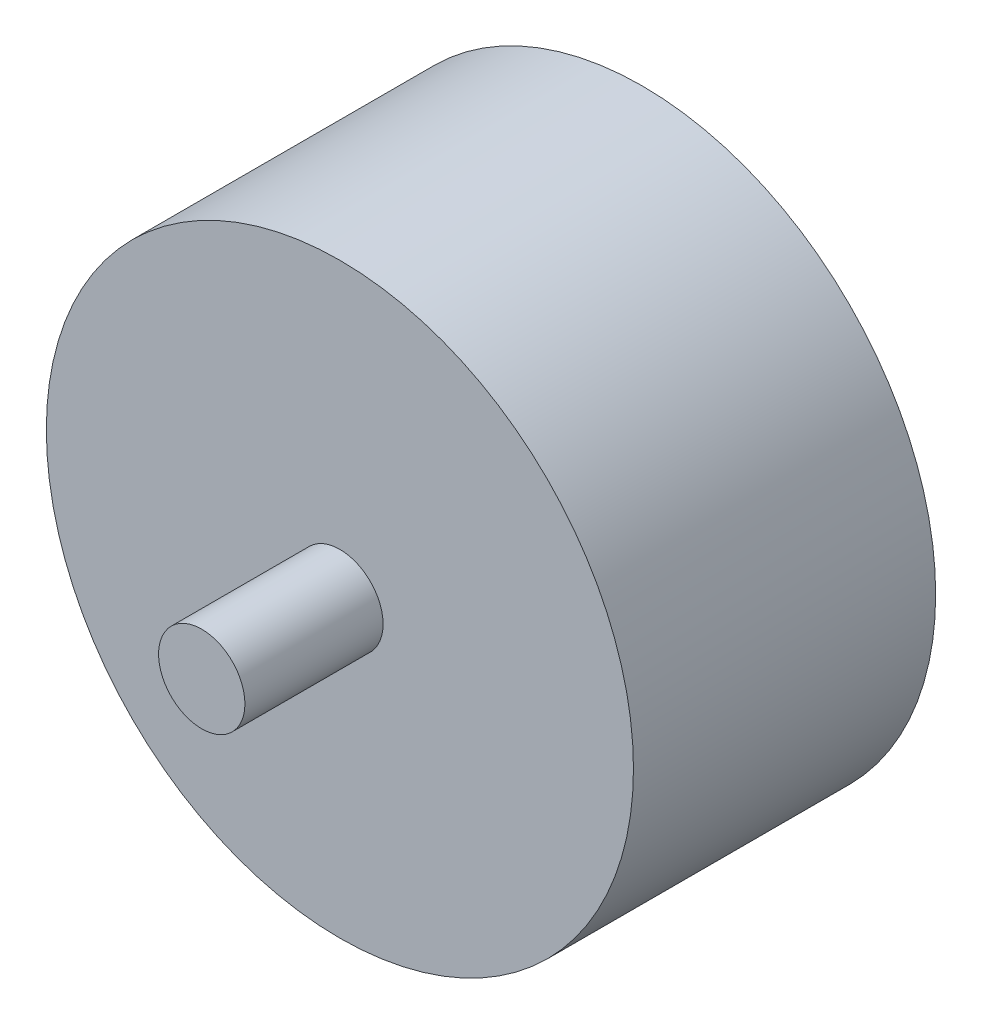
ISO-10303-21;
HEADER;
FILE_DESCRIPTION(('STEP AP214'),'2;1');
FILE_NAME('part.step','',(''),(''),'','','');
FILE_SCHEMA(('AUTOMOTIVE_DESIGN { 1 0 10303 214 1 1 1 1 }'));
ENDSEC;
DATA;
#1=APPLICATION_CONTEXT('core data for automotive mechanical design processes');
#2=APPLICATION_PROTOCOL_DEFINITION('international standard','automotive_design',2000,#1);
#3=PRODUCT_CONTEXT('',#1,'mechanical');
#4=PRODUCT('Part','Part','',(#3));
#5=PRODUCT_RELATED_PRODUCT_CATEGORY('part','',(#4));
#6=PRODUCT_DEFINITION_FORMATION('','',#4);
#7=PRODUCT_DEFINITION_CONTEXT('part definition',#1,'design');
#8=PRODUCT_DEFINITION('design','',#6,#7);
#9=PRODUCT_DEFINITION_SHAPE('','',#8);
#10=(LENGTH_UNIT() NAMED_UNIT(*) SI_UNIT(.MILLI.,.METRE.));
#11=(NAMED_UNIT(*) PLANE_ANGLE_UNIT() SI_UNIT($,.RADIAN.));
#12=(NAMED_UNIT(*) SI_UNIT($,.STERADIAN.) SOLID_ANGLE_UNIT());
#13=UNCERTAINTY_MEASURE_WITH_UNIT(LENGTH_MEASURE(1.E-05),#10,'distance_accuracy_value','');
#14=(GEOMETRIC_REPRESENTATION_CONTEXT(3) GLOBAL_UNCERTAINTY_ASSIGNED_CONTEXT((#13)) GLOBAL_UNIT_ASSIGNED_CONTEXT((#10,
#11,#12)) REPRESENTATION_CONTEXT('',''));
#15=CARTESIAN_POINT('',(0.,0.,0.));
#16=DIRECTION('',(0.,0.,1.));
#17=DIRECTION('',(1.,0.,0.));
#18=AXIS2_PLACEMENT_3D('',#15,#16,#17);
#19=CARTESIAN_POINT('',(0.,0.,25.5));
#20=DIRECTION('',(0.,0.,-1.));
#21=DIRECTION('',(-1.,0.,0.));
#22=AXIS2_PLACEMENT_3D('',#19,#20,#21);
#23=CYLINDRICAL_SURFACE('',#22,17.);
#24=CARTESIAN_POINT('',(0.,0.,0.));
#25=DIRECTION('',(0.,0.,1.));
#26=DIRECTION('',(1.,0.,0.));
#27=AXIS2_PLACEMENT_3D('',#24,#25,#26);
#28=CIRCLE('',#27,17.);
#29=CARTESIAN_POINT('',(17.,0.,0.));
#30=VERTEX_POINT('',#29);
#31=EDGE_CURVE('E11',#30,#30,#28,.T.);
#32=ORIENTED_EDGE('',*,*,#31,.T.);
#33=EDGE_LOOP('',(#32));
#34=FACE_BOUND('',#33,.T.);
#35=CARTESIAN_POINT('',(0.,0.,17.5));
#36=DIRECTION('',(0.,0.,1.));
#37=DIRECTION('',(1.,0.,0.));
#38=AXIS2_PLACEMENT_3D('',#35,#36,#37);
#39=CIRCLE('',#38,17.);
#40=CARTESIAN_POINT('',(17.,0.,17.5));
#41=VERTEX_POINT('',#40);
#42=EDGE_CURVE('E44',#41,#41,#39,.T.);
#43=ORIENTED_EDGE('',*,*,#42,.F.);
#44=EDGE_LOOP('',(#43));
#45=FACE_BOUND('',#44,.T.);
#46=ADVANCED_FACE('F38',(#34,#45),#23,.T.);
#47=CARTESIAN_POINT('',(0.,0.,0.));
#48=DIRECTION('',(0.,0.,1.));
#49=DIRECTION('',(1.,0.,0.));
#50=AXIS2_PLACEMENT_3D('',#47,#48,#49);
#51=PLANE('',#50);
#52=ORIENTED_EDGE('',*,*,#31,.F.);
#53=EDGE_LOOP('',(#52));
#54=FACE_BOUND('',#53,.T.);
#55=ADVANCED_FACE('F70',(#54),#51,.F.);
#56=CARTESIAN_POINT('',(0.,0.,17.5));
#57=DIRECTION('',(0.,0.,1.));
#58=DIRECTION('',(1.,0.,0.));
#59=AXIS2_PLACEMENT_3D('',#56,#57,#58);
#60=PLANE('',#59);
#61=CARTESIAN_POINT('',(0.,0.,17.5));
#62=DIRECTION('',(0.,0.,1.));
#63=DIRECTION('',(1.,0.,0.));
#64=AXIS2_PLACEMENT_3D('',#61,#62,#63);
#65=CIRCLE('',#64,2.5);
#66=CARTESIAN_POINT('',(2.5,0.,17.5));
#67=VERTEX_POINT('',#66);
#68=EDGE_CURVE('E48',#67,#67,#65,.T.);
#69=ORIENTED_EDGE('',*,*,#68,.F.);
#70=EDGE_LOOP('',(#69));
#71=FACE_BOUND('',#70,.T.);
#72=ORIENTED_EDGE('',*,*,#42,.T.);
#73=EDGE_LOOP('',(#72));
#74=FACE_BOUND('',#73,.T.);
#75=ADVANCED_FACE('F62',(#71,#74),#60,.T.);
#76=CARTESIAN_POINT('',(0.,0.,17.5));
#77=DIRECTION('',(0.,0.,1.));
#78=DIRECTION('',(1.,0.,0.));
#79=AXIS2_PLACEMENT_3D('',#76,#77,#78);
#80=CYLINDRICAL_SURFACE('',#79,2.5);
#81=ORIENTED_EDGE('',*,*,#68,.T.);
#82=EDGE_LOOP('',(#81));
#83=FACE_BOUND('',#82,.T.);
#84=CARTESIAN_POINT('',(0.,0.,25.5));
#85=DIRECTION('',(0.,0.,1.));
#86=DIRECTION('',(1.,0.,0.));
#87=AXIS2_PLACEMENT_3D('',#84,#85,#86);
#88=CIRCLE('',#87,2.5);
#89=CARTESIAN_POINT('',(2.5,0.,25.5));
#90=VERTEX_POINT('',#89);
#91=EDGE_CURVE('E52',#90,#90,#88,.T.);
#92=ORIENTED_EDGE('',*,*,#91,.F.);
#93=EDGE_LOOP('',(#92));
#94=FACE_BOUND('',#93,.T.);
#95=ADVANCED_FACE('F60',(#83,#94),#80,.T.);
#96=CARTESIAN_POINT('',(0.,0.,25.5));
#97=DIRECTION('',(0.,0.,1.));
#98=DIRECTION('',(1.,0.,0.));
#99=AXIS2_PLACEMENT_3D('',#96,#97,#98);
#100=PLANE('',#99);
#101=ORIENTED_EDGE('',*,*,#91,.T.);
#102=EDGE_LOOP('',(#101));
#103=FACE_BOUND('',#102,.T.);
#104=ADVANCED_FACE('F58',(#103),#100,.T.);
#105=CLOSED_SHELL('',(#46,#55,#75,#95,#104));
#106=MANIFOLD_SOLID_BREP('B2',#105);
#107=ADVANCED_BREP_SHAPE_REPRESENTATION('',(#18,#106),#14);
#108=SHAPE_DEFINITION_REPRESENTATION(#9,#107);
ENDSEC;
END-ISO-10303-21;
